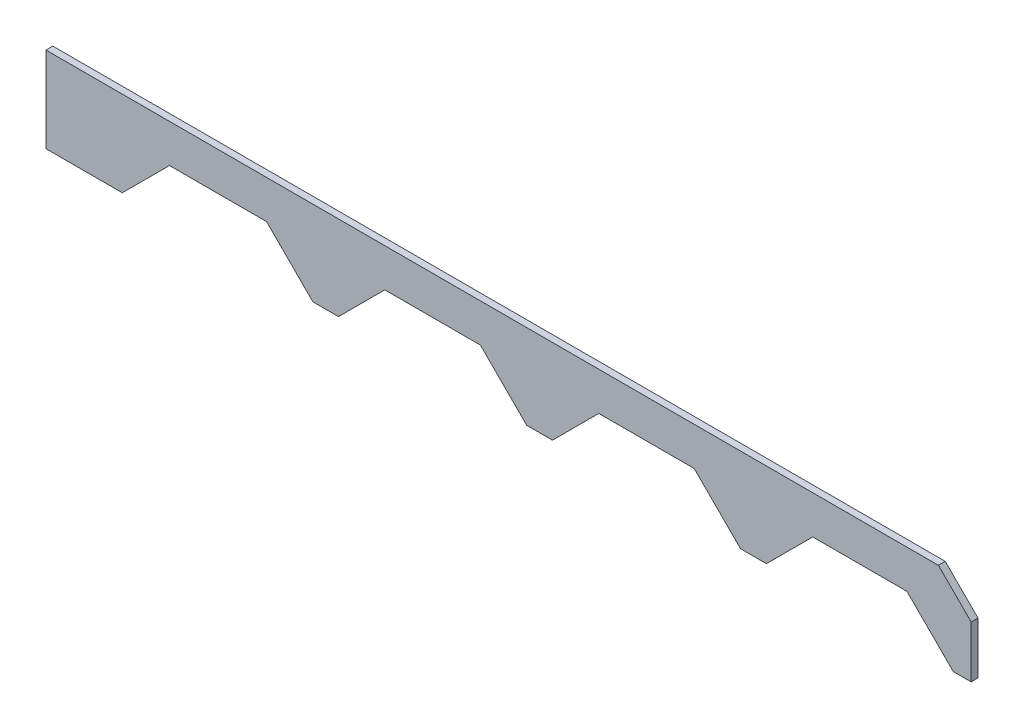
ISO-10303-21;
HEADER;
FILE_DESCRIPTION(('STEP AP214'),'2;1');
FILE_NAME('part.step','',(''),(''),'','','');
FILE_SCHEMA(('AUTOMOTIVE_DESIGN { 1 0 10303 214 1 1 1 1 }'));
ENDSEC;
DATA;
#1=APPLICATION_CONTEXT('core data for automotive mechanical design processes');
#2=APPLICATION_PROTOCOL_DEFINITION('international standard','automotive_design',2000,#1);
#3=PRODUCT_CONTEXT('',#1,'mechanical');
#4=PRODUCT('Part','Part','',(#3));
#5=PRODUCT_RELATED_PRODUCT_CATEGORY('part','',(#4));
#6=PRODUCT_DEFINITION_FORMATION('','',#4);
#7=PRODUCT_DEFINITION_CONTEXT('part definition',#1,'design');
#8=PRODUCT_DEFINITION('design','',#6,#7);
#9=PRODUCT_DEFINITION_SHAPE('','',#8);
#10=(LENGTH_UNIT() NAMED_UNIT(*) SI_UNIT(.MILLI.,.METRE.));
#11=(NAMED_UNIT(*) PLANE_ANGLE_UNIT() SI_UNIT($,.RADIAN.));
#12=(NAMED_UNIT(*) SI_UNIT($,.STERADIAN.) SOLID_ANGLE_UNIT());
#13=UNCERTAINTY_MEASURE_WITH_UNIT(LENGTH_MEASURE(1.E-05),#10,'distance_accuracy_value','');
#14=(GEOMETRIC_REPRESENTATION_CONTEXT(3) GLOBAL_UNCERTAINTY_ASSIGNED_CONTEXT((#13)) GLOBAL_UNIT_ASSIGNED_CONTEXT((#10,
#11,#12)) REPRESENTATION_CONTEXT('',''));
#15=CARTESIAN_POINT('',(0.,0.,0.));
#16=DIRECTION('',(0.,0.,1.));
#17=DIRECTION('',(1.,0.,0.));
#18=AXIS2_PLACEMENT_3D('',#15,#16,#17);
#19=CARTESIAN_POINT('',(38.7249984741211,85.2750015258789,0.));
#20=DIRECTION('',(-3.36096777050352E-07,-0.999999999999943,0.));
#21=DIRECTION('',(0.999999999999943,-3.36096777050352E-07,0.));
#22=AXIS2_PLACEMENT_3D('',#19,#20,#21);
#23=PLANE('',#22);
#24=DIRECTION('',(0.999999999999943,-3.36096777050352E-07,0.));
#25=VECTOR('',#24,1.);
#26=CARTESIAN_POINT('',(38.7249984741211,85.2750015258789,0.));
#27=LINE('',#26,#25);
#28=CARTESIAN_POINT('',(38.7249984741211,85.2750015258789,0.));
#29=VERTEX_POINT('',#28);
#30=CARTESIAN_POINT('',(61.424991607666,85.2749938964844,0.));
#31=VERTEX_POINT('',#30);
#32=EDGE_CURVE('E11',#29,#31,#27,.T.);
#33=ORIENTED_EDGE('',*,*,#32,.T.);
#34=DIRECTION('',(0.,0.,1.));
#35=VECTOR('',#34,1.);
#36=CARTESIAN_POINT('',(61.424991607666,85.2749938964844,0.));
#37=LINE('',#36,#35);
#38=CARTESIAN_POINT('',(61.424991607666,85.2749938964844,1.59999930858612));
#39=VERTEX_POINT('',#38);
#40=EDGE_CURVE('E310',#31,#39,#37,.T.);
#41=ORIENTED_EDGE('',*,*,#40,.T.);
#42=DIRECTION('',(0.999999999999943,-3.36096777050352E-07,0.));
#43=VECTOR('',#42,1.);
#44=CARTESIAN_POINT('',(38.7249984741211,85.2750015258789,1.59999930858612));
#45=LINE('',#44,#43);
#46=CARTESIAN_POINT('',(38.7249984741211,85.2750015258789,1.59999930858612));
#47=VERTEX_POINT('',#46);
#48=EDGE_CURVE('E304',#47,#39,#45,.T.);
#49=ORIENTED_EDGE('',*,*,#48,.F.);
#50=DIRECTION('',(0.,0.,1.));
#51=VECTOR('',#50,1.);
#52=CARTESIAN_POINT('',(38.7249984741211,85.2750015258789,0.));
#53=LINE('',#52,#51);
#54=EDGE_CURVE('E175',#29,#47,#53,.T.);
#55=ORIENTED_EDGE('',*,*,#54,.F.);
#56=EDGE_LOOP('',(#33,#41,#49,#55));
#57=FACE_BOUND('',#56,.T.);
#58=ADVANCED_FACE('F17',(#57),#23,.T.);
#59=CARTESIAN_POINT('',(61.424991607666,85.2749938964844,0.));
#60=DIRECTION('',(-0.70710640741284,-0.707107154960057,0.));
#61=DIRECTION('',(0.707107154960057,-0.70710640741284,0.));
#62=AXIS2_PLACEMENT_3D('',#59,#60,#61);
#63=PLANE('',#62);
#64=DIRECTION('',(0.707107154960057,-0.70710640741284,0.));
#65=VECTOR('',#64,1.);
#66=CARTESIAN_POINT('',(61.424991607666,85.2749938964844,0.));
#67=LINE('',#66,#65);
#68=CARTESIAN_POINT('',(72.2499923706055,74.4500045776367,0.));
#69=VERTEX_POINT('',#68);
#70=EDGE_CURVE('E24',#31,#69,#67,.T.);
#71=ORIENTED_EDGE('',*,*,#70,.T.);
#72=DIRECTION('',(0.,0.,1.));
#73=VECTOR('',#72,1.);
#74=CARTESIAN_POINT('',(72.2499923706055,74.4500045776367,0.));
#75=LINE('',#74,#73);
#76=CARTESIAN_POINT('',(72.2499923706055,74.4500045776367,1.59999930858612));
#77=VERTEX_POINT('',#76);
#78=EDGE_CURVE('E306',#69,#77,#75,.T.);
#79=ORIENTED_EDGE('',*,*,#78,.T.);
#80=DIRECTION('',(0.707107154960057,-0.70710640741284,0.));
#81=VECTOR('',#80,1.);
#82=CARTESIAN_POINT('',(61.424991607666,85.2749938964844,1.59999930858612));
#83=LINE('',#82,#81);
#84=EDGE_CURVE('E297',#39,#77,#83,.T.);
#85=ORIENTED_EDGE('',*,*,#84,.F.);
#86=ORIENTED_EDGE('',*,*,#40,.F.);
#87=EDGE_LOOP('',(#71,#79,#85,#86));
#88=FACE_BOUND('',#87,.T.);
#89=ADVANCED_FACE('F312',(#88),#63,.T.);
#90=CARTESIAN_POINT('',(72.2499923706055,74.4500045776367,0.));
#91=DIRECTION('',(0.,-1.,0.));
#92=DIRECTION('',(1.,0.,0.));
#93=AXIS2_PLACEMENT_3D('',#90,#91,#92);
#94=PLANE('',#93);
#95=DIRECTION('',(1.,0.,0.));
#96=VECTOR('',#95,1.);
#97=CARTESIAN_POINT('',(72.2499923706055,74.4500045776367,0.));
#98=LINE('',#97,#96);
#99=CARTESIAN_POINT('',(78.2249984741211,74.4500045776367,0.));
#100=VERTEX_POINT('',#99);
#101=EDGE_CURVE('E308',#69,#100,#98,.T.);
#102=ORIENTED_EDGE('',*,*,#101,.T.);
#103=DIRECTION('',(0.,0.,1.));
#104=VECTOR('',#103,1.);
#105=CARTESIAN_POINT('',(78.2249984741211,74.4500045776367,0.));
#106=LINE('',#105,#104);
#107=CARTESIAN_POINT('',(78.2249984741211,74.4500045776367,1.59999930858612));
#108=VERTEX_POINT('',#107);
#109=EDGE_CURVE('E300',#100,#108,#106,.T.);
#110=ORIENTED_EDGE('',*,*,#109,.T.);
#111=DIRECTION('',(1.,0.,0.));
#112=VECTOR('',#111,1.);
#113=CARTESIAN_POINT('',(72.2499923706055,74.4500045776367,1.59999930858612));
#114=LINE('',#113,#112);
#115=EDGE_CURVE('E289',#77,#108,#114,.T.);
#116=ORIENTED_EDGE('',*,*,#115,.F.);
#117=ORIENTED_EDGE('',*,*,#78,.F.);
#118=EDGE_LOOP('',(#102,#110,#116,#117));
#119=FACE_BOUND('',#118,.T.);
#120=ADVANCED_FACE('F316',(#119),#94,.T.);
#121=CARTESIAN_POINT('',(78.2249984741211,74.4500045776367,0.));
#122=DIRECTION('',(0.707106282821649,-0.707107279551095,0.));
#123=DIRECTION('',(0.707107279551095,0.707106282821649,0.));
#124=AXIS2_PLACEMENT_3D('',#121,#122,#123);
#125=PLANE('',#124);
#126=DIRECTION('',(0.707107279551095,0.707106282821649,0.));
#127=VECTOR('',#126,1.);
#128=CARTESIAN_POINT('',(78.2249984741211,74.4500045776367,0.));
#129=LINE('',#128,#127);
#130=CARTESIAN_POINT('',(89.0500030517578,85.2749938964844,0.));
#131=VERTEX_POINT('',#130);
#132=EDGE_CURVE('E302',#100,#131,#129,.T.);
#133=ORIENTED_EDGE('',*,*,#132,.T.);
#134=DIRECTION('',(0.,0.,1.));
#135=VECTOR('',#134,1.);
#136=CARTESIAN_POINT('',(89.0500030517578,85.2749938964844,0.));
#137=LINE('',#136,#135);
#138=CARTESIAN_POINT('',(89.0500030517578,85.2749938964844,1.59999930858612));
#139=VERTEX_POINT('',#138);
#140=EDGE_CURVE('E292',#131,#139,#137,.T.);
#141=ORIENTED_EDGE('',*,*,#140,.T.);
#142=DIRECTION('',(0.707107279551095,0.707106282821649,0.));
#143=VECTOR('',#142,1.);
#144=CARTESIAN_POINT('',(78.2249984741211,74.4500045776367,1.59999930858612));
#145=LINE('',#144,#143);
#146=EDGE_CURVE('E282',#108,#139,#145,.T.);
#147=ORIENTED_EDGE('',*,*,#146,.F.);
#148=ORIENTED_EDGE('',*,*,#109,.F.);
#149=EDGE_LOOP('',(#133,#141,#147,#148));
#150=FACE_BOUND('',#149,.T.);
#151=ADVANCED_FACE('F321',(#150),#125,.T.);
#152=CARTESIAN_POINT('',(89.0500030517578,85.2749938964844,0.));
#153=DIRECTION('',(0.,-1.,0.));
#154=DIRECTION('',(1.,0.,0.));
#155=AXIS2_PLACEMENT_3D('',#152,#153,#154);
#156=PLANE('',#155);
#157=DIRECTION('',(1.,0.,0.));
#158=VECTOR('',#157,1.);
#159=CARTESIAN_POINT('',(89.0500030517578,85.2749938964844,0.));
#160=LINE('',#159,#158);
#161=CARTESIAN_POINT('',(111.400001525879,85.2749938964844,0.));
#162=VERTEX_POINT('',#161);
#163=EDGE_CURVE('E294',#131,#162,#160,.T.);
#164=ORIENTED_EDGE('',*,*,#163,.T.);
#165=DIRECTION('',(0.,0.,1.));
#166=VECTOR('',#165,1.);
#167=CARTESIAN_POINT('',(111.400001525879,85.2749938964844,0.));
#168=LINE('',#167,#166);
#169=CARTESIAN_POINT('',(111.400001525879,85.2749938964844,1.59999930858612));
#170=VERTEX_POINT('',#169);
#171=EDGE_CURVE('E285',#162,#170,#168,.T.);
#172=ORIENTED_EDGE('',*,*,#171,.T.);
#173=DIRECTION('',(1.,0.,0.));
#174=VECTOR('',#173,1.);
#175=CARTESIAN_POINT('',(89.0500030517578,85.2749938964844,1.59999930858612));
#176=LINE('',#175,#174);
#177=EDGE_CURVE('E275',#139,#170,#176,.T.);
#178=ORIENTED_EDGE('',*,*,#177,.F.);
#179=ORIENTED_EDGE('',*,*,#140,.F.);
#180=EDGE_LOOP('',(#164,#172,#178,#179));
#181=FACE_BOUND('',#180,.T.);
#182=ADVANCED_FACE('F326',(#181),#156,.T.);
#183=CARTESIAN_POINT('',(111.400001525879,85.2749938964844,0.));
#184=DIRECTION('',(-0.707107279551095,-0.707106282821649,0.));
#185=DIRECTION('',(0.707106282821649,-0.707107279551095,0.));
#186=AXIS2_PLACEMENT_3D('',#183,#184,#185);
#187=PLANE('',#186);
#188=DIRECTION('',(0.707106282821649,-0.707107279551095,0.));
#189=VECTOR('',#188,1.);
#190=CARTESIAN_POINT('',(111.400001525879,85.2749938964844,0.));
#191=LINE('',#190,#189);
#192=CARTESIAN_POINT('',(122.224990844727,74.4499893188477,0.));
#193=VERTEX_POINT('',#192);
#194=EDGE_CURVE('E287',#162,#193,#191,.T.);
#195=ORIENTED_EDGE('',*,*,#194,.T.);
#196=DIRECTION('',(0.,0.,1.));
#197=VECTOR('',#196,1.);
#198=CARTESIAN_POINT('',(122.224990844727,74.4499893188477,0.));
#199=LINE('',#198,#197);
#200=CARTESIAN_POINT('',(122.224990844727,74.4499893188477,1.59999930858612));
#201=VERTEX_POINT('',#200);
#202=EDGE_CURVE('E278',#193,#201,#199,.T.);
#203=ORIENTED_EDGE('',*,*,#202,.T.);
#204=DIRECTION('',(0.707106282821649,-0.707107279551095,0.));
#205=VECTOR('',#204,1.);
#206=CARTESIAN_POINT('',(111.400001525879,85.2749938964844,1.59999930858612));
#207=LINE('',#206,#205);
#208=EDGE_CURVE('E268',#170,#201,#207,.T.);
#209=ORIENTED_EDGE('',*,*,#208,.F.);
#210=ORIENTED_EDGE('',*,*,#171,.F.);
#211=EDGE_LOOP('',(#195,#203,#209,#210));
#212=FACE_BOUND('',#211,.T.);
#213=ADVANCED_FACE('F331',(#212),#187,.T.);
#214=CARTESIAN_POINT('',(122.224990844727,74.4499893188477,0.));
#215=DIRECTION('',(1.26628762457003E-06,-0.999999999999198,0.));
#216=DIRECTION('',(0.999999999999198,1.26628762457003E-06,0.));
#217=AXIS2_PLACEMENT_3D('',#214,#215,#216);
#218=PLANE('',#217);
#219=DIRECTION('',(0.999999999999198,1.26628762457003E-06,0.));
#220=VECTOR('',#219,1.);
#221=CARTESIAN_POINT('',(122.224990844727,74.4499893188477,0.));
#222=LINE('',#221,#220);
#223=CARTESIAN_POINT('',(128.25,74.4499969482422,0.));
#224=VERTEX_POINT('',#223);
#225=EDGE_CURVE('E280',#193,#224,#222,.T.);
#226=ORIENTED_EDGE('',*,*,#225,.T.);
#227=DIRECTION('',(0.,0.,1.));
#228=VECTOR('',#227,1.);
#229=CARTESIAN_POINT('',(128.25,74.4499969482422,0.));
#230=LINE('',#229,#228);
#231=CARTESIAN_POINT('',(128.25,74.4499969482422,1.59999930858612));
#232=VERTEX_POINT('',#231);
#233=EDGE_CURVE('E271',#224,#232,#230,.T.);
#234=ORIENTED_EDGE('',*,*,#233,.T.);
#235=DIRECTION('',(0.999999999999198,1.26628762457003E-06,0.));
#236=VECTOR('',#235,1.);
#237=CARTESIAN_POINT('',(122.224990844727,74.4499893188477,1.59999930858612));
#238=LINE('',#237,#236);
#239=EDGE_CURVE('E261',#201,#232,#238,.T.);
#240=ORIENTED_EDGE('',*,*,#239,.F.);
#241=ORIENTED_EDGE('',*,*,#202,.F.);
#242=EDGE_LOOP('',(#226,#234,#240,#241));
#243=FACE_BOUND('',#242,.T.);
#244=ADVANCED_FACE('F336',(#243),#218,.T.);
#245=CARTESIAN_POINT('',(128.25,74.4499969482422,0.));
#246=DIRECTION('',(0.707106532004405,-0.707107030368602,0.));
#247=DIRECTION('',(0.707107030368602,0.707106532004405,0.));
#248=AXIS2_PLACEMENT_3D('',#245,#246,#247);
#249=PLANE('',#248);
#250=DIRECTION('',(0.707107030368602,0.707106532004405,0.));
#251=VECTOR('',#250,1.);
#252=CARTESIAN_POINT('',(128.25,74.4499969482422,0.));
#253=LINE('',#252,#251);
#254=CARTESIAN_POINT('',(139.075012207031,85.2750015258789,0.));
#255=VERTEX_POINT('',#254);
#256=EDGE_CURVE('E273',#224,#255,#253,.T.);
#257=ORIENTED_EDGE('',*,*,#256,.T.);
#258=DIRECTION('',(0.,0.,1.));
#259=VECTOR('',#258,1.);
#260=CARTESIAN_POINT('',(139.075012207031,85.2750015258789,0.));
#261=LINE('',#260,#259);
#262=CARTESIAN_POINT('',(139.075012207031,85.2750015258789,1.59999930858612));
#263=VERTEX_POINT('',#262);
#264=EDGE_CURVE('E264',#255,#263,#261,.T.);
#265=ORIENTED_EDGE('',*,*,#264,.T.);
#266=DIRECTION('',(0.707107030368602,0.707106532004405,0.));
#267=VECTOR('',#266,1.);
#268=CARTESIAN_POINT('',(128.25,74.4499969482422,1.59999930858612));
#269=LINE('',#268,#267);
#270=EDGE_CURVE('E254',#232,#263,#269,.T.);
#271=ORIENTED_EDGE('',*,*,#270,.F.);
#272=ORIENTED_EDGE('',*,*,#233,.F.);
#273=EDGE_LOOP('',(#257,#265,#271,#272));
#274=FACE_BOUND('',#273,.T.);
#275=ADVANCED_FACE('F341',(#274),#249,.T.);
#276=CARTESIAN_POINT('',(139.075012207031,85.2750015258789,0.));
#277=DIRECTION('',(6.84251473364325E-07,-0.999999999999766,0.));
#278=DIRECTION('',(0.999999999999766,6.84251473364325E-07,0.));
#279=AXIS2_PLACEMENT_3D('',#276,#277,#278);
#280=PLANE('',#279);
#281=DIRECTION('',(0.999999999999766,6.84251473364325E-07,0.));
#282=VECTOR('',#281,1.);
#283=CARTESIAN_POINT('',(139.075012207031,85.2750015258789,0.));
#284=LINE('',#283,#282);
#285=CARTESIAN_POINT('',(161.374984741211,85.275016784668,0.));
#286=VERTEX_POINT('',#285);
#287=EDGE_CURVE('E266',#255,#286,#284,.T.);
#288=ORIENTED_EDGE('',*,*,#287,.T.);
#289=DIRECTION('',(0.,0.,1.));
#290=VECTOR('',#289,1.);
#291=CARTESIAN_POINT('',(161.374984741211,85.275016784668,0.));
#292=LINE('',#291,#290);
#293=CARTESIAN_POINT('',(161.374984741211,85.275016784668,1.59999930858612));
#294=VERTEX_POINT('',#293);
#295=EDGE_CURVE('E257',#286,#294,#292,.T.);
#296=ORIENTED_EDGE('',*,*,#295,.T.);
#297=DIRECTION('',(0.999999999999766,6.84251473364325E-07,0.));
#298=VECTOR('',#297,1.);
#299=CARTESIAN_POINT('',(139.075012207031,85.2750015258789,1.59999930858612));
#300=LINE('',#299,#298);
#301=EDGE_CURVE('E247',#263,#294,#300,.T.);
#302=ORIENTED_EDGE('',*,*,#301,.F.);
#303=ORIENTED_EDGE('',*,*,#264,.F.);
#304=EDGE_LOOP('',(#288,#296,#302,#303));
#305=FACE_BOUND('',#304,.T.);
#306=ADVANCED_FACE('F346',(#305),#280,.T.);
#307=CARTESIAN_POINT('',(161.374984741211,85.275016784668,0.));
#308=DIRECTION('',(-0.707106781186547,-0.707106781186547,0.));
#309=DIRECTION('',(0.707106781186547,-0.707106781186547,0.));
#310=AXIS2_PLACEMENT_3D('',#307,#308,#309);
#311=PLANE('',#310);
#312=DIRECTION('',(0.707106781186547,-0.707106781186547,0.));
#313=VECTOR('',#312,1.);
#314=CARTESIAN_POINT('',(161.374984741211,85.275016784668,0.));
#315=LINE('',#314,#313);
#316=CARTESIAN_POINT('',(172.199996948242,74.4500045776367,0.));
#317=VERTEX_POINT('',#316);
#318=EDGE_CURVE('E259',#286,#317,#315,.T.);
#319=ORIENTED_EDGE('',*,*,#318,.T.);
#320=DIRECTION('',(0.,0.,1.));
#321=VECTOR('',#320,1.);
#322=CARTESIAN_POINT('',(172.199996948242,74.4500045776367,0.));
#323=LINE('',#322,#321);
#324=CARTESIAN_POINT('',(172.199996948242,74.4500045776367,1.59999930858612));
#325=VERTEX_POINT('',#324);
#326=EDGE_CURVE('E250',#317,#325,#323,.T.);
#327=ORIENTED_EDGE('',*,*,#326,.T.);
#328=DIRECTION('',(0.707106781186547,-0.707106781186547,0.));
#329=VECTOR('',#328,1.);
#330=CARTESIAN_POINT('',(161.374984741211,85.275016784668,1.59999930858612));
#331=LINE('',#330,#329);
#332=EDGE_CURVE('E240',#294,#325,#331,.T.);
#333=ORIENTED_EDGE('',*,*,#332,.F.);
#334=ORIENTED_EDGE('',*,*,#295,.F.);
#335=EDGE_LOOP('',(#319,#327,#333,#334));
#336=FACE_BOUND('',#335,.T.);
#337=ADVANCED_FACE('F351',(#336),#311,.T.);
#338=CARTESIAN_POINT('',(172.199996948242,74.4500045776367,0.));
#339=DIRECTION('',(0.,-1.,0.));
#340=DIRECTION('',(1.,0.,0.));
#341=AXIS2_PLACEMENT_3D('',#338,#339,#340);
#342=PLANE('',#341);
#343=DIRECTION('',(1.,0.,0.));
#344=VECTOR('',#343,1.);
#345=CARTESIAN_POINT('',(172.199996948242,74.4500045776367,0.));
#346=LINE('',#345,#344);
#347=CARTESIAN_POINT('',(178.25,74.4500045776367,0.));
#348=VERTEX_POINT('',#347);
#349=EDGE_CURVE('E252',#317,#348,#346,.T.);
#350=ORIENTED_EDGE('',*,*,#349,.T.);
#351=DIRECTION('',(0.,0.,1.));
#352=VECTOR('',#351,1.);
#353=CARTESIAN_POINT('',(178.25,74.4500045776367,0.));
#354=LINE('',#353,#352);
#355=CARTESIAN_POINT('',(178.25,74.4500045776367,1.59999930858612));
#356=VERTEX_POINT('',#355);
#357=EDGE_CURVE('E243',#348,#356,#354,.T.);
#358=ORIENTED_EDGE('',*,*,#357,.T.);
#359=DIRECTION('',(1.,0.,0.));
#360=VECTOR('',#359,1.);
#361=CARTESIAN_POINT('',(172.199996948242,74.4500045776367,1.59999930858612));
#362=LINE('',#361,#360);
#363=EDGE_CURVE('E233',#325,#356,#362,.T.);
#364=ORIENTED_EDGE('',*,*,#363,.F.);
#365=ORIENTED_EDGE('',*,*,#326,.F.);
#366=EDGE_LOOP('',(#350,#358,#364,#365));
#367=FACE_BOUND('',#366,.T.);
#368=ADVANCED_FACE('F356',(#367),#342,.T.);
#369=CARTESIAN_POINT('',(178.25,74.4500045776367,0.));
#370=DIRECTION('',(0.707106781186547,-0.707106781186547,0.));
#371=DIRECTION('',(0.707106781186547,0.707106781186547,0.));
#372=AXIS2_PLACEMENT_3D('',#369,#370,#371);
#373=PLANE('',#372);
#374=DIRECTION('',(0.707106781186547,0.707106781186547,0.));
#375=VECTOR('',#374,1.);
#376=CARTESIAN_POINT('',(178.25,74.4500045776367,0.));
#377=LINE('',#376,#375);
#378=CARTESIAN_POINT('',(189.075012207031,85.275016784668,0.));
#379=VERTEX_POINT('',#378);
#380=EDGE_CURVE('E245',#348,#379,#377,.T.);
#381=ORIENTED_EDGE('',*,*,#380,.T.);
#382=DIRECTION('',(0.,0.,1.));
#383=VECTOR('',#382,1.);
#384=CARTESIAN_POINT('',(189.075012207031,85.275016784668,0.));
#385=LINE('',#384,#383);
#386=CARTESIAN_POINT('',(189.075012207031,85.275016784668,1.59999930858612));
#387=VERTEX_POINT('',#386);
#388=EDGE_CURVE('E236',#379,#387,#385,.T.);
#389=ORIENTED_EDGE('',*,*,#388,.T.);
#390=DIRECTION('',(0.707106781186547,0.707106781186547,0.));
#391=VECTOR('',#390,1.);
#392=CARTESIAN_POINT('',(178.25,74.4500045776367,1.59999930858612));
#393=LINE('',#392,#391);
#394=EDGE_CURVE('E226',#356,#387,#393,.T.);
#395=ORIENTED_EDGE('',*,*,#394,.F.);
#396=ORIENTED_EDGE('',*,*,#357,.F.);
#397=EDGE_LOOP('',(#381,#389,#395,#396));
#398=FACE_BOUND('',#397,.T.);
#399=ADVANCED_FACE('F361',(#398),#373,.T.);
#400=CARTESIAN_POINT('',(189.075012207031,85.275016784668,0.));
#401=DIRECTION('',(0.,-1.,0.));
#402=DIRECTION('',(1.,0.,0.));
#403=AXIS2_PLACEMENT_3D('',#400,#401,#402);
#404=PLANE('',#403);
#405=DIRECTION('',(1.,0.,0.));
#406=VECTOR('',#405,1.);
#407=CARTESIAN_POINT('',(189.075012207031,85.275016784668,0.));
#408=LINE('',#407,#406);
#409=CARTESIAN_POINT('',(211.099990844727,85.275016784668,0.));
#410=VERTEX_POINT('',#409);
#411=EDGE_CURVE('E238',#379,#410,#408,.T.);
#412=ORIENTED_EDGE('',*,*,#411,.T.);
#413=DIRECTION('',(0.,0.,1.));
#414=VECTOR('',#413,1.);
#415=CARTESIAN_POINT('',(211.099990844727,85.275016784668,0.));
#416=LINE('',#415,#414);
#417=CARTESIAN_POINT('',(211.099990844727,85.275016784668,1.59999930858612));
#418=VERTEX_POINT('',#417);
#419=EDGE_CURVE('E229',#410,#418,#416,.T.);
#420=ORIENTED_EDGE('',*,*,#419,.T.);
#421=DIRECTION('',(1.,0.,0.));
#422=VECTOR('',#421,1.);
#423=CARTESIAN_POINT('',(189.075012207031,85.275016784668,1.59999930858612));
#424=LINE('',#423,#422);
#425=EDGE_CURVE('E219',#387,#418,#424,.T.);
#426=ORIENTED_EDGE('',*,*,#425,.F.);
#427=ORIENTED_EDGE('',*,*,#388,.F.);
#428=EDGE_LOOP('',(#412,#420,#426,#427));
#429=FACE_BOUND('',#428,.T.);
#430=ADVANCED_FACE('F366',(#429),#404,.T.);
#431=CARTESIAN_POINT('',(211.099990844727,85.275016784668,0.));
#432=DIRECTION('',(-0.707106781186547,-0.707106781186547,0.));
#433=DIRECTION('',(0.707106781186547,-0.707106781186547,0.));
#434=AXIS2_PLACEMENT_3D('',#431,#432,#433);
#435=PLANE('',#434);
#436=DIRECTION('',(0.707106781186547,-0.707106781186547,0.));
#437=VECTOR('',#436,1.);
#438=CARTESIAN_POINT('',(211.099990844727,85.275016784668,0.));
#439=LINE('',#438,#437);
#440=CARTESIAN_POINT('',(221.925003051758,74.4500045776367,0.));
#441=VERTEX_POINT('',#440);
#442=EDGE_CURVE('E231',#410,#441,#439,.T.);
#443=ORIENTED_EDGE('',*,*,#442,.T.);
#444=DIRECTION('',(0.,0.,1.));
#445=VECTOR('',#444,1.);
#446=CARTESIAN_POINT('',(221.925003051758,74.4500045776367,0.));
#447=LINE('',#446,#445);
#448=CARTESIAN_POINT('',(221.925003051758,74.4500045776367,1.59999930858612));
#449=VERTEX_POINT('',#448);
#450=EDGE_CURVE('E222',#441,#449,#447,.T.);
#451=ORIENTED_EDGE('',*,*,#450,.T.);
#452=DIRECTION('',(0.707106781186547,-0.707106781186547,0.));
#453=VECTOR('',#452,1.);
#454=CARTESIAN_POINT('',(211.099990844727,85.275016784668,1.59999930858612));
#455=LINE('',#454,#453);
#456=EDGE_CURVE('E212',#418,#449,#455,.T.);
#457=ORIENTED_EDGE('',*,*,#456,.F.);
#458=ORIENTED_EDGE('',*,*,#419,.F.);
#459=EDGE_LOOP('',(#443,#451,#457,#458));
#460=FACE_BOUND('',#459,.T.);
#461=ADVANCED_FACE('F371',(#460),#435,.T.);
#462=CARTESIAN_POINT('',(221.925003051758,74.4500045776367,0.));
#463=DIRECTION('',(0.,-1.,0.));
#464=DIRECTION('',(1.,0.,0.));
#465=AXIS2_PLACEMENT_3D('',#462,#463,#464);
#466=PLANE('',#465);
#467=DIRECTION('',(1.,0.,0.));
#468=VECTOR('',#467,1.);
#469=CARTESIAN_POINT('',(221.925003051758,74.4500045776367,0.));
#470=LINE('',#469,#468);
#471=CARTESIAN_POINT('',(226.099990844727,74.4500045776367,0.));
#472=VERTEX_POINT('',#471);
#473=EDGE_CURVE('E224',#441,#472,#470,.T.);
#474=ORIENTED_EDGE('',*,*,#473,.T.);
#475=DIRECTION('',(0.,0.,1.));
#476=VECTOR('',#475,1.);
#477=CARTESIAN_POINT('',(226.099990844727,74.4500045776367,0.));
#478=LINE('',#477,#476);
#479=CARTESIAN_POINT('',(226.099990844727,74.4500045776367,1.59999930858612));
#480=VERTEX_POINT('',#479);
#481=EDGE_CURVE('E215',#472,#480,#478,.T.);
#482=ORIENTED_EDGE('',*,*,#481,.T.);
#483=DIRECTION('',(1.,0.,0.));
#484=VECTOR('',#483,1.);
#485=CARTESIAN_POINT('',(221.925003051758,74.4500045776367,1.59999930858612));
#486=LINE('',#485,#484);
#487=EDGE_CURVE('E205',#449,#480,#486,.T.);
#488=ORIENTED_EDGE('',*,*,#487,.F.);
#489=ORIENTED_EDGE('',*,*,#450,.F.);
#490=EDGE_LOOP('',(#474,#482,#488,#489));
#491=FACE_BOUND('',#490,.T.);
#492=ADVANCED_FACE('F376',(#491),#466,.T.);
#493=CARTESIAN_POINT('',(226.099990844727,74.4500045776367,0.));
#494=DIRECTION('',(1.,0.,0.));
#495=DIRECTION('',(0.,1.,0.));
#496=AXIS2_PLACEMENT_3D('',#493,#494,#495);
#497=PLANE('',#496);
#498=DIRECTION('',(0.,1.,0.));
#499=VECTOR('',#498,1.);
#500=CARTESIAN_POINT('',(226.099990844727,74.4500045776367,0.));
#501=LINE('',#500,#499);
#502=CARTESIAN_POINT('',(226.099990844727,86.5750045776367,0.));
#503=VERTEX_POINT('',#502);
#504=EDGE_CURVE('E217',#472,#503,#501,.T.);
#505=ORIENTED_EDGE('',*,*,#504,.T.);
#506=DIRECTION('',(0.,0.,1.));
#507=VECTOR('',#506,1.);
#508=CARTESIAN_POINT('',(226.099990844727,86.5750045776367,0.));
#509=LINE('',#508,#507);
#510=CARTESIAN_POINT('',(226.099990844727,86.5750045776367,1.59999930858612));
#511=VERTEX_POINT('',#510);
#512=EDGE_CURVE('E208',#503,#511,#509,.T.);
#513=ORIENTED_EDGE('',*,*,#512,.T.);
#514=DIRECTION('',(0.,1.,0.));
#515=VECTOR('',#514,1.);
#516=CARTESIAN_POINT('',(226.099990844727,74.4500045776367,1.59999930858612));
#517=LINE('',#516,#515);
#518=EDGE_CURVE('E198',#480,#511,#517,.T.);
#519=ORIENTED_EDGE('',*,*,#518,.F.);
#520=ORIENTED_EDGE('',*,*,#481,.F.);
#521=EDGE_LOOP('',(#505,#513,#519,#520));
#522=FACE_BOUND('',#521,.T.);
#523=ADVANCED_FACE('F381',(#522),#497,.T.);
#524=CARTESIAN_POINT('',(226.099990844727,86.5750045776367,0.));
#525=DIRECTION('',(0.70710537077686,0.707108191593422,0.));
#526=DIRECTION('',(-0.707108191593422,0.70710537077686,0.));
#527=AXIS2_PLACEMENT_3D('',#524,#525,#526);
#528=PLANE('',#527);
#529=DIRECTION('',(-0.707108191593422,0.70710537077686,0.));
#530=VECTOR('',#529,1.);
#531=CARTESIAN_POINT('',(226.099990844727,86.5750045776367,0.));
#532=LINE('',#531,#530);
#533=CARTESIAN_POINT('',(218.449996948242,94.224967956543,0.));
#534=VERTEX_POINT('',#533);
#535=EDGE_CURVE('E210',#503,#534,#532,.T.);
#536=ORIENTED_EDGE('',*,*,#535,.T.);
#537=DIRECTION('',(0.,0.,1.));
#538=VECTOR('',#537,1.);
#539=CARTESIAN_POINT('',(218.449996948242,94.224967956543,0.));
#540=LINE('',#539,#538);
#541=CARTESIAN_POINT('',(218.449996948242,94.224967956543,1.59999930858612));
#542=VERTEX_POINT('',#541);
#543=EDGE_CURVE('E201',#534,#542,#540,.T.);
#544=ORIENTED_EDGE('',*,*,#543,.T.);
#545=DIRECTION('',(-0.707108191593422,0.70710537077686,0.));
#546=VECTOR('',#545,1.);
#547=CARTESIAN_POINT('',(226.099990844727,86.5750045776367,1.59999930858612));
#548=LINE('',#547,#546);
#549=EDGE_CURVE('E191',#511,#542,#548,.T.);
#550=ORIENTED_EDGE('',*,*,#549,.F.);
#551=ORIENTED_EDGE('',*,*,#512,.F.);
#552=EDGE_LOOP('',(#536,#544,#550,#551));
#553=FACE_BOUND('',#552,.T.);
#554=ADVANCED_FACE('F386',(#553),#528,.T.);
#555=CARTESIAN_POINT('',(218.449996948242,94.224967956543,0.));
#556=DIRECTION('',(1.46314650139791E-07,0.999999999999989,0.));
#557=DIRECTION('',(-0.999999999999989,1.46314650139791E-07,0.));
#558=AXIS2_PLACEMENT_3D('',#555,#556,#557);
#559=PLANE('',#558);
#560=DIRECTION('',(-0.999999999999989,1.46314650139791E-07,0.));
#561=VECTOR('',#560,1.);
#562=CARTESIAN_POINT('',(218.449996948242,94.224967956543,0.));
#563=LINE('',#562,#561);
#564=CARTESIAN_POINT('',(9.87499713897705,94.2249984741211,0.));
#565=VERTEX_POINT('',#564);
#566=EDGE_CURVE('E203',#534,#565,#563,.T.);
#567=ORIENTED_EDGE('',*,*,#566,.T.);
#568=DIRECTION('',(0.,0.,1.));
#569=VECTOR('',#568,1.);
#570=CARTESIAN_POINT('',(9.87499713897702,94.2249984741211,0.));
#571=LINE('',#570,#569);
#572=CARTESIAN_POINT('',(9.87499713897705,94.2249984741211,1.59999930858612));
#573=VERTEX_POINT('',#572);
#574=EDGE_CURVE('E194',#565,#573,#571,.T.);
#575=ORIENTED_EDGE('',*,*,#574,.T.);
#576=DIRECTION('',(-0.999999999999989,1.46314650139791E-07,0.));
#577=VECTOR('',#576,1.);
#578=CARTESIAN_POINT('',(218.449996948242,94.224967956543,1.59999930858612));
#579=LINE('',#578,#577);
#580=EDGE_CURVE('E186',#542,#573,#579,.T.);
#581=ORIENTED_EDGE('',*,*,#580,.F.);
#582=ORIENTED_EDGE('',*,*,#543,.F.);
#583=EDGE_LOOP('',(#567,#575,#581,#582));
#584=FACE_BOUND('',#583,.T.);
#585=ADVANCED_FACE('F390',(#584),#559,.T.);
#586=CARTESIAN_POINT('',(9.87499713897705,94.2249984741211,0.));
#587=DIRECTION('',(-0.999999999999972,-2.38716902378912E-07,0.));
#588=DIRECTION('',(2.38716902378912E-07,-0.999999999999972,0.));
#589=AXIS2_PLACEMENT_3D('',#586,#587,#588);
#590=PLANE('',#589);
#591=DIRECTION('',(2.38716902378912E-07,-0.999999999999972,0.));
#592=VECTOR('',#591,1.);
#593=CARTESIAN_POINT('',(9.87499713897705,94.2249984741211,0.));
#594=LINE('',#593,#592);
#595=CARTESIAN_POINT('',(9.87500190734863,74.2499923706055,0.));
#596=VERTEX_POINT('',#595);
#597=EDGE_CURVE('E196',#565,#596,#594,.T.);
#598=ORIENTED_EDGE('',*,*,#597,.T.);
#599=DIRECTION('',(0.,0.,1.));
#600=VECTOR('',#599,1.);
#601=CARTESIAN_POINT('',(9.87500190734863,74.2499923706055,0.));
#602=LINE('',#601,#600);
#603=CARTESIAN_POINT('',(9.87500190734863,74.2499923706055,1.59999930858612));
#604=VERTEX_POINT('',#603);
#605=EDGE_CURVE('E188',#596,#604,#602,.T.);
#606=ORIENTED_EDGE('',*,*,#605,.T.);
#607=DIRECTION('',(2.38716902378912E-07,-0.999999999999972,0.));
#608=VECTOR('',#607,1.);
#609=CARTESIAN_POINT('',(9.87499713897705,94.2249984741211,1.59999930858612));
#610=LINE('',#609,#608);
#611=EDGE_CURVE('E169',#573,#604,#610,.T.);
#612=ORIENTED_EDGE('',*,*,#611,.F.);
#613=ORIENTED_EDGE('',*,*,#574,.F.);
#614=EDGE_LOOP('',(#598,#606,#612,#613));
#615=FACE_BOUND('',#614,.T.);
#616=ADVANCED_FACE('F395',(#615),#590,.T.);
#617=CARTESIAN_POINT('',(9.87500190734863,74.2499923706055,0.));
#618=DIRECTION('',(8.56033101943706E-07,-0.999999999999634,0.));
#619=DIRECTION('',(0.999999999999634,8.56033101943706E-07,0.));
#620=AXIS2_PLACEMENT_3D('',#617,#618,#619);
#621=PLANE('',#620);
#622=DIRECTION('',(0.999999999999634,8.56033101943705E-07,0.));
#623=VECTOR('',#622,1.);
#624=CARTESIAN_POINT('',(9.87500190734863,74.2499923706055,0.));
#625=LINE('',#624,#623);
#626=CARTESIAN_POINT('',(27.7000007629395,74.2500076293945,0.));
#627=VERTEX_POINT('',#626);
#628=EDGE_CURVE('E164',#596,#627,#625,.T.);
#629=ORIENTED_EDGE('',*,*,#628,.T.);
#630=DIRECTION('',(0.,0.,1.));
#631=VECTOR('',#630,1.);
#632=CARTESIAN_POINT('',(27.7000007629395,74.2500076293945,0.));
#633=LINE('',#632,#631);
#634=CARTESIAN_POINT('',(27.7000007629395,74.2500076293945,1.59999930858612));
#635=VERTEX_POINT('',#634);
#636=EDGE_CURVE('E156',#627,#635,#633,.T.);
#637=ORIENTED_EDGE('',*,*,#636,.T.);
#638=DIRECTION('',(0.999999999999634,8.56033101943705E-07,0.));
#639=VECTOR('',#638,1.);
#640=CARTESIAN_POINT('',(9.87500190734863,74.2499923706055,1.59999930858612));
#641=LINE('',#640,#639);
#642=EDGE_CURVE('E161',#604,#635,#641,.T.);
#643=ORIENTED_EDGE('',*,*,#642,.F.);
#644=ORIENTED_EDGE('',*,*,#605,.F.);
#645=EDGE_LOOP('',(#629,#637,#643,#644));
#646=FACE_BOUND('',#645,.T.);
#647=ADVANCED_FACE('F158',(#646),#621,.T.);
#648=CARTESIAN_POINT('',(27.7000007629395,74.2500076293945,0.));
#649=DIRECTION('',(0.707106658855502,-0.707106903517572,0.));
#650=DIRECTION('',(0.707106903517572,0.707106658855502,0.));
#651=AXIS2_PLACEMENT_3D('',#648,#649,#650);
#652=PLANE('',#651);
#653=DIRECTION('',(0.707106903517572,0.707106658855502,0.));
#654=VECTOR('',#653,1.);
#655=CARTESIAN_POINT('',(27.7000007629395,74.2500076293945,0.));
#656=LINE('',#655,#654);
#657=EDGE_CURVE('E168',#627,#29,#656,.T.);
#658=ORIENTED_EDGE('',*,*,#657,.T.);
#659=ORIENTED_EDGE('',*,*,#54,.T.);
#660=DIRECTION('',(0.707106903517572,0.707106658855502,0.));
#661=VECTOR('',#660,1.);
#662=CARTESIAN_POINT('',(27.7000007629395,74.2500076293945,1.59999930858612));
#663=LINE('',#662,#661);
#664=EDGE_CURVE('E173',#635,#47,#663,.T.);
#665=ORIENTED_EDGE('',*,*,#664,.F.);
#666=ORIENTED_EDGE('',*,*,#636,.F.);
#667=EDGE_LOOP('',(#658,#659,#665,#666));
#668=FACE_BOUND('',#667,.T.);
#669=ADVANCED_FACE('F174',(#668),#652,.T.);
#670=CARTESIAN_POINT('',(0.,0.,1.59999930858612));
#671=DIRECTION('',(0.,0.,1.));
#672=DIRECTION('',(1.,0.,0.));
#673=AXIS2_PLACEMENT_3D('',#670,#671,#672);
#674=PLANE('',#673);
#675=ORIENTED_EDGE('',*,*,#48,.T.);
#676=ORIENTED_EDGE('',*,*,#84,.T.);
#677=ORIENTED_EDGE('',*,*,#115,.T.);
#678=ORIENTED_EDGE('',*,*,#146,.T.);
#679=ORIENTED_EDGE('',*,*,#177,.T.);
#680=ORIENTED_EDGE('',*,*,#208,.T.);
#681=ORIENTED_EDGE('',*,*,#239,.T.);
#682=ORIENTED_EDGE('',*,*,#270,.T.);
#683=ORIENTED_EDGE('',*,*,#301,.T.);
#684=ORIENTED_EDGE('',*,*,#332,.T.);
#685=ORIENTED_EDGE('',*,*,#363,.T.);
#686=ORIENTED_EDGE('',*,*,#394,.T.);
#687=ORIENTED_EDGE('',*,*,#425,.T.);
#688=ORIENTED_EDGE('',*,*,#456,.T.);
#689=ORIENTED_EDGE('',*,*,#487,.T.);
#690=ORIENTED_EDGE('',*,*,#518,.T.);
#691=ORIENTED_EDGE('',*,*,#549,.T.);
#692=ORIENTED_EDGE('',*,*,#580,.T.);
#693=ORIENTED_EDGE('',*,*,#611,.T.);
#694=ORIENTED_EDGE('',*,*,#642,.T.);
#695=ORIENTED_EDGE('',*,*,#664,.T.);
#696=EDGE_LOOP('',(#675,#676,#677,#678,#679,#680,#681,#682,#683,#684,#685,#686,#687,#688,#689,
#690,#691,#692,#693,#694,#695));
#697=FACE_BOUND('',#696,.T.);
#698=ADVANCED_FACE('F179',(#697),#674,.T.);
#699=CARTESIAN_POINT('',(0.,0.,0.));
#700=DIRECTION('',(0.,0.,1.));
#701=DIRECTION('',(1.,0.,0.));
#702=AXIS2_PLACEMENT_3D('',#699,#700,#701);
#703=PLANE('',#702);
#704=ORIENTED_EDGE('',*,*,#657,.F.);
#705=ORIENTED_EDGE('',*,*,#628,.F.);
#706=ORIENTED_EDGE('',*,*,#597,.F.);
#707=ORIENTED_EDGE('',*,*,#566,.F.);
#708=ORIENTED_EDGE('',*,*,#535,.F.);
#709=ORIENTED_EDGE('',*,*,#504,.F.);
#710=ORIENTED_EDGE('',*,*,#473,.F.);
#711=ORIENTED_EDGE('',*,*,#442,.F.);
#712=ORIENTED_EDGE('',*,*,#411,.F.);
#713=ORIENTED_EDGE('',*,*,#380,.F.);
#714=ORIENTED_EDGE('',*,*,#349,.F.);
#715=ORIENTED_EDGE('',*,*,#318,.F.);
#716=ORIENTED_EDGE('',*,*,#287,.F.);
#717=ORIENTED_EDGE('',*,*,#256,.F.);
#718=ORIENTED_EDGE('',*,*,#225,.F.);
#719=ORIENTED_EDGE('',*,*,#194,.F.);
#720=ORIENTED_EDGE('',*,*,#163,.F.);
#721=ORIENTED_EDGE('',*,*,#132,.F.);
#722=ORIENTED_EDGE('',*,*,#101,.F.);
#723=ORIENTED_EDGE('',*,*,#70,.F.);
#724=ORIENTED_EDGE('',*,*,#32,.F.);
#725=EDGE_LOOP('',(#704,#705,#706,#707,#708,#709,#710,#711,#712,#713,#714,#715,#716,#717,#718,
#719,#720,#721,#722,#723,#724));
#726=FACE_BOUND('',#725,.T.);
#727=ADVANCED_FACE('F397',(#726),#703,.F.);
#728=CLOSED_SHELL('',(#58,#89,#120,#151,#182,#213,#244,#275,#306,#337,#368,#399,#430,#461,#492,
#523,#554,#585,#616,#647,#669,#698,#727));
#729=MANIFOLD_SOLID_BREP('B1',#728);
#730=ADVANCED_BREP_SHAPE_REPRESENTATION('',(#18,#729),#14);
#731=SHAPE_DEFINITION_REPRESENTATION(#9,#730);
ENDSEC;
END-ISO-10303-21;
